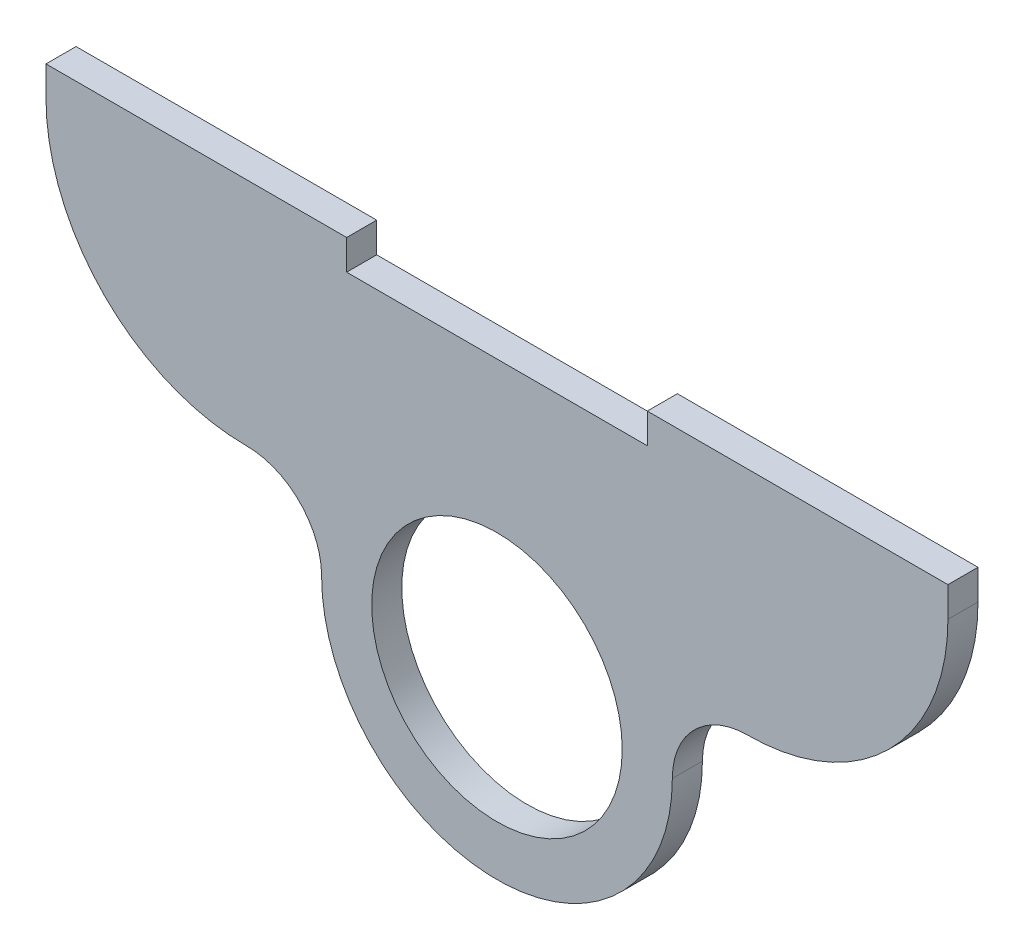
ISO-10303-21;
HEADER;
FILE_DESCRIPTION(('STEP AP214'),'2;1');
FILE_NAME('part.step','',(''),(''),'','','');
FILE_SCHEMA(('AUTOMOTIVE_DESIGN { 1 0 10303 214 1 1 1 1 }'));
ENDSEC;
DATA;
#1=APPLICATION_CONTEXT('core data for automotive mechanical design processes');
#2=APPLICATION_PROTOCOL_DEFINITION('international standard','automotive_design',2000,#1);
#3=PRODUCT_CONTEXT('',#1,'mechanical');
#4=PRODUCT('Part','Part','',(#3));
#5=PRODUCT_RELATED_PRODUCT_CATEGORY('part','',(#4));
#6=PRODUCT_DEFINITION_FORMATION('','',#4);
#7=PRODUCT_DEFINITION_CONTEXT('part definition',#1,'design');
#8=PRODUCT_DEFINITION('design','',#6,#7);
#9=PRODUCT_DEFINITION_SHAPE('','',#8);
#10=(LENGTH_UNIT() NAMED_UNIT(*) SI_UNIT(.MILLI.,.METRE.));
#11=(NAMED_UNIT(*) PLANE_ANGLE_UNIT() SI_UNIT($,.RADIAN.));
#12=(NAMED_UNIT(*) SI_UNIT($,.STERADIAN.) SOLID_ANGLE_UNIT());
#13=UNCERTAINTY_MEASURE_WITH_UNIT(LENGTH_MEASURE(1.E-05),#10,'distance_accuracy_value','');
#14=(GEOMETRIC_REPRESENTATION_CONTEXT(3) GLOBAL_UNCERTAINTY_ASSIGNED_CONTEXT((#13)) GLOBAL_UNIT_ASSIGNED_CONTEXT((#10,
#11,#12)) REPRESENTATION_CONTEXT('',''));
#15=CARTESIAN_POINT('',(0.,0.,0.));
#16=DIRECTION('',(0.,0.,1.));
#17=DIRECTION('',(1.,0.,0.));
#18=AXIS2_PLACEMENT_3D('',#15,#16,#17);
#19=CARTESIAN_POINT('',(-25.,27.5,3.));
#20=DIRECTION('',(0.,0.,1.));
#21=DIRECTION('',(1.,0.,0.));
#22=AXIS2_PLACEMENT_3D('',#19,#20,#21);
#23=PLANE('',#22);
#24=CARTESIAN_POINT('',(-25.,27.5,3.));
#25=DIRECTION('',(0.,0.,1.));
#26=DIRECTION('',(1.,0.,0.));
#27=AXIS2_PLACEMENT_3D('',#24,#25,#26);
#28=CIRCLE('',#27,20.);
#29=CARTESIAN_POINT('',(-45.,27.5,3.));
#30=VERTEX_POINT('',#29);
#31=CARTESIAN_POINT('',(-25.,7.5,3.));
#32=VERTEX_POINT('',#31);
#33=EDGE_CURVE('E187',#30,#32,#28,.T.);
#34=ORIENTED_EDGE('',*,*,#33,.T.);
#35=CARTESIAN_POINT('',(-25.,0.,3.));
#36=DIRECTION('',(0.,0.,-1.));
#37=DIRECTION('',(1.,0.,0.));
#38=AXIS2_PLACEMENT_3D('',#35,#36,#37);
#39=CIRCLE('',#38,7.5);
#40=CARTESIAN_POINT('',(-17.5,0.,3.));
#41=VERTEX_POINT('',#40);
#42=EDGE_CURVE('E115',#32,#41,#39,.T.);
#43=ORIENTED_EDGE('',*,*,#42,.T.);
#44=CARTESIAN_POINT('',(0.,0.,3.));
#45=DIRECTION('',(0.,0.,1.));
#46=DIRECTION('',(1.,0.,0.));
#47=AXIS2_PLACEMENT_3D('',#44,#45,#46);
#48=CIRCLE('',#47,17.5);
#49=CARTESIAN_POINT('',(17.5,0.,3.));
#50=VERTEX_POINT('',#49);
#51=EDGE_CURVE('E214',#41,#50,#48,.T.);
#52=ORIENTED_EDGE('',*,*,#51,.T.);
#53=CARTESIAN_POINT('',(25.,0.,3.));
#54=DIRECTION('',(0.,0.,-1.));
#55=DIRECTION('',(-1.,0.,0.));
#56=AXIS2_PLACEMENT_3D('',#53,#54,#55);
#57=CIRCLE('',#56,7.5);
#58=CARTESIAN_POINT('',(25.,7.5,3.));
#59=VERTEX_POINT('',#58);
#60=EDGE_CURVE('E233',#50,#59,#57,.T.);
#61=ORIENTED_EDGE('',*,*,#60,.T.);
#62=CARTESIAN_POINT('',(25.,27.5,3.));
#63=DIRECTION('',(0.,0.,1.));
#64=DIRECTION('',(1.,0.,0.));
#65=AXIS2_PLACEMENT_3D('',#62,#63,#64);
#66=CIRCLE('',#65,20.);
#67=CARTESIAN_POINT('',(45.,27.5,3.));
#68=VERTEX_POINT('',#67);
#69=EDGE_CURVE('E230',#59,#68,#66,.T.);
#70=ORIENTED_EDGE('',*,*,#69,.T.);
#71=DIRECTION('',(0.,1.,0.));
#72=VECTOR('',#71,1.);
#73=CARTESIAN_POINT('',(45.,27.5,3.));
#74=LINE('',#73,#72);
#75=CARTESIAN_POINT('',(45.,30.5,3.));
#76=VERTEX_POINT('',#75);
#77=EDGE_CURVE('E232',#68,#76,#74,.T.);
#78=ORIENTED_EDGE('',*,*,#77,.T.);
#79=DIRECTION('',(-1.,0.,0.));
#80=VECTOR('',#79,1.);
#81=CARTESIAN_POINT('',(45.,30.5,3.));
#82=LINE('',#81,#80);
#83=CARTESIAN_POINT('',(15.,30.5,3.));
#84=VERTEX_POINT('',#83);
#85=EDGE_CURVE('E235',#76,#84,#82,.T.);
#86=ORIENTED_EDGE('',*,*,#85,.T.);
#87=DIRECTION('',(0.,-1.,0.));
#88=VECTOR('',#87,1.);
#89=CARTESIAN_POINT('',(15.,27.5,3.));
#90=LINE('',#89,#88);
#91=CARTESIAN_POINT('',(15.,27.5,3.));
#92=VERTEX_POINT('',#91);
#93=EDGE_CURVE('E241',#84,#92,#90,.T.);
#94=ORIENTED_EDGE('',*,*,#93,.T.);
#95=DIRECTION('',(-1.,0.,0.));
#96=VECTOR('',#95,1.);
#97=CARTESIAN_POINT('',(-15.,27.5,3.));
#98=LINE('',#97,#96);
#99=CARTESIAN_POINT('',(-15.,27.5,3.));
#100=VERTEX_POINT('',#99);
#101=EDGE_CURVE('E146',#92,#100,#98,.T.);
#102=ORIENTED_EDGE('',*,*,#101,.T.);
#103=DIRECTION('',(0.,1.,0.));
#104=VECTOR('',#103,1.);
#105=CARTESIAN_POINT('',(-15.,27.5,3.));
#106=LINE('',#105,#104);
#107=CARTESIAN_POINT('',(-15.,30.5,3.));
#108=VERTEX_POINT('',#107);
#109=EDGE_CURVE('E140',#100,#108,#106,.T.);
#110=ORIENTED_EDGE('',*,*,#109,.T.);
#111=DIRECTION('',(-1.,0.,0.));
#112=VECTOR('',#111,1.);
#113=CARTESIAN_POINT('',(-45.,30.5,3.));
#114=LINE('',#113,#112);
#115=CARTESIAN_POINT('',(-45.,30.5,3.));
#116=VERTEX_POINT('',#115);
#117=EDGE_CURVE('E144',#108,#116,#114,.T.);
#118=ORIENTED_EDGE('',*,*,#117,.T.);
#119=DIRECTION('',(0.,-1.,0.));
#120=VECTOR('',#119,1.);
#121=CARTESIAN_POINT('',(-45.,27.5,3.));
#122=LINE('',#121,#120);
#123=EDGE_CURVE('E60',#116,#30,#122,.T.);
#124=ORIENTED_EDGE('',*,*,#123,.T.);
#125=EDGE_LOOP('',(#34,#43,#52,#61,#70,#78,#86,#94,#102,#110,#118,#124));
#126=FACE_BOUND('',#125,.T.);
#127=CARTESIAN_POINT('',(0.,0.,3.));
#128=DIRECTION('',(0.,0.,1.));
#129=DIRECTION('',(1.,0.,0.));
#130=AXIS2_PLACEMENT_3D('',#127,#128,#129);
#131=CIRCLE('',#130,12.5);
#132=CARTESIAN_POINT('',(12.5,0.,3.));
#133=VERTEX_POINT('',#132);
#134=EDGE_CURVE('E168',#133,#133,#131,.T.);
#135=ORIENTED_EDGE('',*,*,#134,.F.);
#136=EDGE_LOOP('',(#135));
#137=FACE_BOUND('',#136,.T.);
#138=ADVANCED_FACE('F43',(#126,#137),#23,.T.);
#139=CARTESIAN_POINT('',(-25.,27.5,0.));
#140=DIRECTION('',(0.,0.,1.));
#141=DIRECTION('',(1.,0.,0.));
#142=AXIS2_PLACEMENT_3D('',#139,#140,#141);
#143=PLANE('',#142);
#144=CARTESIAN_POINT('',(-25.,27.5,0.));
#145=DIRECTION('',(0.,0.,1.));
#146=DIRECTION('',(1.,0.,0.));
#147=AXIS2_PLACEMENT_3D('',#144,#145,#146);
#148=CIRCLE('',#147,20.);
#149=CARTESIAN_POINT('',(-45.,27.5,0.));
#150=VERTEX_POINT('',#149);
#151=CARTESIAN_POINT('',(-25.,7.5,0.));
#152=VERTEX_POINT('',#151);
#153=EDGE_CURVE('E164',#150,#152,#148,.T.);
#154=ORIENTED_EDGE('',*,*,#153,.F.);
#155=DIRECTION('',(0.,-1.,0.));
#156=VECTOR('',#155,1.);
#157=CARTESIAN_POINT('',(-45.,27.5,0.));
#158=LINE('',#157,#156);
#159=CARTESIAN_POINT('',(-45.,30.5,0.));
#160=VERTEX_POINT('',#159);
#161=EDGE_CURVE('E107',#160,#150,#158,.T.);
#162=ORIENTED_EDGE('',*,*,#161,.F.);
#163=DIRECTION('',(-1.,0.,0.));
#164=VECTOR('',#163,1.);
#165=CARTESIAN_POINT('',(-45.,30.5,0.));
#166=LINE('',#165,#164);
#167=CARTESIAN_POINT('',(-15.,30.5,0.));
#168=VERTEX_POINT('',#167);
#169=EDGE_CURVE('E101',#168,#160,#166,.T.);
#170=ORIENTED_EDGE('',*,*,#169,.F.);
#171=DIRECTION('',(0.,1.,0.));
#172=VECTOR('',#171,1.);
#173=CARTESIAN_POINT('',(-15.,27.5,0.));
#174=LINE('',#173,#172);
#175=CARTESIAN_POINT('',(-15.,27.5,0.));
#176=VERTEX_POINT('',#175);
#177=EDGE_CURVE('E154',#176,#168,#174,.T.);
#178=ORIENTED_EDGE('',*,*,#177,.F.);
#179=DIRECTION('',(-1.,0.,0.));
#180=VECTOR('',#179,1.);
#181=CARTESIAN_POINT('',(-15.,27.5,0.));
#182=LINE('',#181,#180);
#183=CARTESIAN_POINT('',(15.,27.5,0.));
#184=VERTEX_POINT('',#183);
#185=EDGE_CURVE('E182',#184,#176,#182,.T.);
#186=ORIENTED_EDGE('',*,*,#185,.F.);
#187=DIRECTION('',(0.,-1.,0.));
#188=VECTOR('',#187,1.);
#189=CARTESIAN_POINT('',(15.,27.5,0.));
#190=LINE('',#189,#188);
#191=CARTESIAN_POINT('',(15.,30.5,0.));
#192=VERTEX_POINT('',#191);
#193=EDGE_CURVE('E180',#192,#184,#190,.T.);
#194=ORIENTED_EDGE('',*,*,#193,.F.);
#195=DIRECTION('',(-1.,0.,0.));
#196=VECTOR('',#195,1.);
#197=CARTESIAN_POINT('',(45.,30.5,0.));
#198=LINE('',#197,#196);
#199=CARTESIAN_POINT('',(45.,30.5,0.));
#200=VERTEX_POINT('',#199);
#201=EDGE_CURVE('E178',#200,#192,#198,.T.);
#202=ORIENTED_EDGE('',*,*,#201,.F.);
#203=DIRECTION('',(0.,1.,0.));
#204=VECTOR('',#203,1.);
#205=CARTESIAN_POINT('',(45.,27.5,0.));
#206=LINE('',#205,#204);
#207=CARTESIAN_POINT('',(45.,27.5,0.));
#208=VERTEX_POINT('',#207);
#209=EDGE_CURVE('E176',#208,#200,#206,.T.);
#210=ORIENTED_EDGE('',*,*,#209,.F.);
#211=CARTESIAN_POINT('',(25.,27.5,0.));
#212=DIRECTION('',(0.,0.,1.));
#213=DIRECTION('',(1.,0.,0.));
#214=AXIS2_PLACEMENT_3D('',#211,#212,#213);
#215=CIRCLE('',#214,20.);
#216=CARTESIAN_POINT('',(25.,7.5,0.));
#217=VERTEX_POINT('',#216);
#218=EDGE_CURVE('E174',#217,#208,#215,.T.);
#219=ORIENTED_EDGE('',*,*,#218,.F.);
#220=CARTESIAN_POINT('',(25.,0.,0.));
#221=DIRECTION('',(0.,0.,-1.));
#222=DIRECTION('',(-1.,0.,0.));
#223=AXIS2_PLACEMENT_3D('',#220,#221,#222);
#224=CIRCLE('',#223,7.5);
#225=CARTESIAN_POINT('',(17.5,0.,0.));
#226=VERTEX_POINT('',#225);
#227=EDGE_CURVE('E172',#226,#217,#224,.T.);
#228=ORIENTED_EDGE('',*,*,#227,.F.);
#229=CARTESIAN_POINT('',(0.,0.,0.));
#230=DIRECTION('',(0.,0.,1.));
#231=DIRECTION('',(1.,0.,0.));
#232=AXIS2_PLACEMENT_3D('',#229,#230,#231);
#233=CIRCLE('',#232,17.5);
#234=CARTESIAN_POINT('',(-17.5,0.,0.));
#235=VERTEX_POINT('',#234);
#236=EDGE_CURVE('E170',#235,#226,#233,.T.);
#237=ORIENTED_EDGE('',*,*,#236,.F.);
#238=CARTESIAN_POINT('',(-25.,0.,0.));
#239=DIRECTION('',(0.,0.,-1.));
#240=DIRECTION('',(1.,0.,0.));
#241=AXIS2_PLACEMENT_3D('',#238,#239,#240);
#242=CIRCLE('',#241,7.5);
#243=EDGE_CURVE('E167',#152,#235,#242,.T.);
#244=ORIENTED_EDGE('',*,*,#243,.F.);
#245=EDGE_LOOP('',(#154,#162,#170,#178,#186,#194,#202,#210,#219,#228,#237,#244));
#246=FACE_BOUND('',#245,.T.);
#247=CARTESIAN_POINT('',(0.,0.,0.));
#248=DIRECTION('',(0.,0.,1.));
#249=DIRECTION('',(1.,0.,0.));
#250=AXIS2_PLACEMENT_3D('',#247,#248,#249);
#251=CIRCLE('',#250,12.5);
#252=CARTESIAN_POINT('',(12.5,0.,0.));
#253=VERTEX_POINT('',#252);
#254=EDGE_CURVE('E388',#253,#253,#251,.T.);
#255=ORIENTED_EDGE('',*,*,#254,.T.);
#256=EDGE_LOOP('',(#255));
#257=FACE_BOUND('',#256,.T.);
#258=ADVANCED_FACE('F218',(#246,#257),#143,.F.);
#259=CARTESIAN_POINT('',(-25.,27.5,3.));
#260=DIRECTION('',(0.,0.,-1.));
#261=DIRECTION('',(-1.,0.,0.));
#262=AXIS2_PLACEMENT_3D('',#259,#260,#261);
#263=CYLINDRICAL_SURFACE('',#262,20.);
#264=ORIENTED_EDGE('',*,*,#153,.T.);
#265=DIRECTION('',(0.,0.,-1.));
#266=VECTOR('',#265,1.);
#267=CARTESIAN_POINT('',(-25.,7.5,3.));
#268=LINE('',#267,#266);
#269=EDGE_CURVE('E13',#32,#152,#268,.T.);
#270=ORIENTED_EDGE('',*,*,#269,.F.);
#271=ORIENTED_EDGE('',*,*,#33,.F.);
#272=DIRECTION('',(0.,0.,-1.));
#273=VECTOR('',#272,1.);
#274=CARTESIAN_POINT('',(-45.,27.5,3.));
#275=LINE('',#274,#273);
#276=EDGE_CURVE('E160',#30,#150,#275,.T.);
#277=ORIENTED_EDGE('',*,*,#276,.T.);
#278=EDGE_LOOP('',(#264,#270,#271,#277));
#279=FACE_BOUND('',#278,.T.);
#280=ADVANCED_FACE('F45',(#279),#263,.T.);
#281=CARTESIAN_POINT('',(-25.,0.,3.));
#282=DIRECTION('',(0.,0.,-1.));
#283=DIRECTION('',(-1.,0.,0.));
#284=AXIS2_PLACEMENT_3D('',#281,#282,#283);
#285=CYLINDRICAL_SURFACE('',#284,7.5);
#286=ORIENTED_EDGE('',*,*,#243,.T.);
#287=DIRECTION('',(0.,0.,-1.));
#288=VECTOR('',#287,1.);
#289=CARTESIAN_POINT('',(-17.5,0.,3.));
#290=LINE('',#289,#288);
#291=EDGE_CURVE('E52',#41,#235,#290,.T.);
#292=ORIENTED_EDGE('',*,*,#291,.F.);
#293=ORIENTED_EDGE('',*,*,#42,.F.);
#294=ORIENTED_EDGE('',*,*,#269,.T.);
#295=EDGE_LOOP('',(#286,#292,#293,#294));
#296=FACE_BOUND('',#295,.T.);
#297=ADVANCED_FACE('F275',(#296),#285,.F.);
#298=CARTESIAN_POINT('',(0.,0.,3.));
#299=DIRECTION('',(0.,0.,-1.));
#300=DIRECTION('',(-1.,0.,0.));
#301=AXIS2_PLACEMENT_3D('',#298,#299,#300);
#302=CYLINDRICAL_SURFACE('',#301,17.5);
#303=ORIENTED_EDGE('',*,*,#236,.T.);
#304=DIRECTION('',(0.,0.,-1.));
#305=VECTOR('',#304,1.);
#306=CARTESIAN_POINT('',(17.5,0.,3.));
#307=LINE('',#306,#305);
#308=EDGE_CURVE('E206',#50,#226,#307,.T.);
#309=ORIENTED_EDGE('',*,*,#308,.F.);
#310=ORIENTED_EDGE('',*,*,#51,.F.);
#311=ORIENTED_EDGE('',*,*,#291,.T.);
#312=EDGE_LOOP('',(#303,#309,#310,#311));
#313=FACE_BOUND('',#312,.T.);
#314=ADVANCED_FACE('F212',(#313),#302,.T.);
#315=CARTESIAN_POINT('',(25.,0.,3.));
#316=DIRECTION('',(0.,0.,-1.));
#317=DIRECTION('',(-1.,0.,0.));
#318=AXIS2_PLACEMENT_3D('',#315,#316,#317);
#319=CYLINDRICAL_SURFACE('',#318,7.5);
#320=ORIENTED_EDGE('',*,*,#227,.T.);
#321=DIRECTION('',(0.,0.,-1.));
#322=VECTOR('',#321,1.);
#323=CARTESIAN_POINT('',(25.,7.5,3.));
#324=LINE('',#323,#322);
#325=EDGE_CURVE('E203',#59,#217,#324,.T.);
#326=ORIENTED_EDGE('',*,*,#325,.F.);
#327=ORIENTED_EDGE('',*,*,#60,.F.);
#328=ORIENTED_EDGE('',*,*,#308,.T.);
#329=EDGE_LOOP('',(#320,#326,#327,#328));
#330=FACE_BOUND('',#329,.T.);
#331=ADVANCED_FACE('F224',(#330),#319,.F.);
#332=CARTESIAN_POINT('',(25.,27.5,3.));
#333=DIRECTION('',(0.,0.,-1.));
#334=DIRECTION('',(-1.,0.,0.));
#335=AXIS2_PLACEMENT_3D('',#332,#333,#334);
#336=CYLINDRICAL_SURFACE('',#335,20.);
#337=ORIENTED_EDGE('',*,*,#218,.T.);
#338=DIRECTION('',(0.,0.,-1.));
#339=VECTOR('',#338,1.);
#340=CARTESIAN_POINT('',(45.,27.5,3.));
#341=LINE('',#340,#339);
#342=EDGE_CURVE('E200',#68,#208,#341,.T.);
#343=ORIENTED_EDGE('',*,*,#342,.F.);
#344=ORIENTED_EDGE('',*,*,#69,.F.);
#345=ORIENTED_EDGE('',*,*,#325,.T.);
#346=EDGE_LOOP('',(#337,#343,#344,#345));
#347=FACE_BOUND('',#346,.T.);
#348=ADVANCED_FACE('F228',(#347),#336,.T.);
#349=CARTESIAN_POINT('',(45.,27.5,3.));
#350=DIRECTION('',(-1.,0.,0.));
#351=DIRECTION('',(0.,0.,1.));
#352=AXIS2_PLACEMENT_3D('',#349,#350,#351);
#353=PLANE('',#352);
#354=ORIENTED_EDGE('',*,*,#209,.T.);
#355=DIRECTION('',(0.,0.,-1.));
#356=VECTOR('',#355,1.);
#357=CARTESIAN_POINT('',(45.,30.5,3.));
#358=LINE('',#357,#356);
#359=EDGE_CURVE('E197',#76,#200,#358,.T.);
#360=ORIENTED_EDGE('',*,*,#359,.F.);
#361=ORIENTED_EDGE('',*,*,#77,.F.);
#362=ORIENTED_EDGE('',*,*,#342,.T.);
#363=EDGE_LOOP('',(#354,#360,#361,#362));
#364=FACE_BOUND('',#363,.T.);
#365=ADVANCED_FACE('F288',(#364),#353,.F.);
#366=CARTESIAN_POINT('',(45.,30.5,3.));
#367=DIRECTION('',(0.,-1.,0.));
#368=DIRECTION('',(0.,0.,-1.));
#369=AXIS2_PLACEMENT_3D('',#366,#367,#368);
#370=PLANE('',#369);
#371=ORIENTED_EDGE('',*,*,#201,.T.);
#372=DIRECTION('',(0.,0.,-1.));
#373=VECTOR('',#372,1.);
#374=CARTESIAN_POINT('',(15.,30.5,3.));
#375=LINE('',#374,#373);
#376=EDGE_CURVE('E194',#84,#192,#375,.T.);
#377=ORIENTED_EDGE('',*,*,#376,.F.);
#378=ORIENTED_EDGE('',*,*,#85,.F.);
#379=ORIENTED_EDGE('',*,*,#359,.T.);
#380=EDGE_LOOP('',(#371,#377,#378,#379));
#381=FACE_BOUND('',#380,.T.);
#382=ADVANCED_FACE('F291',(#381),#370,.F.);
#383=CARTESIAN_POINT('',(15.,27.5,3.));
#384=DIRECTION('',(1.,0.,0.));
#385=DIRECTION('',(0.,0.,-1.));
#386=AXIS2_PLACEMENT_3D('',#383,#384,#385);
#387=PLANE('',#386);
#388=ORIENTED_EDGE('',*,*,#193,.T.);
#389=DIRECTION('',(0.,0.,-1.));
#390=VECTOR('',#389,1.);
#391=CARTESIAN_POINT('',(15.,27.5,3.));
#392=LINE('',#391,#390);
#393=EDGE_CURVE('E191',#92,#184,#392,.T.);
#394=ORIENTED_EDGE('',*,*,#393,.F.);
#395=ORIENTED_EDGE('',*,*,#93,.F.);
#396=ORIENTED_EDGE('',*,*,#376,.T.);
#397=EDGE_LOOP('',(#388,#394,#395,#396));
#398=FACE_BOUND('',#397,.T.);
#399=ADVANCED_FACE('F247',(#398),#387,.F.);
#400=CARTESIAN_POINT('',(-15.,27.5,3.));
#401=DIRECTION('',(0.,-1.,0.));
#402=DIRECTION('',(0.,0.,-1.));
#403=AXIS2_PLACEMENT_3D('',#400,#401,#402);
#404=PLANE('',#403);
#405=ORIENTED_EDGE('',*,*,#185,.T.);
#406=DIRECTION('',(0.,0.,-1.));
#407=VECTOR('',#406,1.);
#408=CARTESIAN_POINT('',(-15.,27.5,3.));
#409=LINE('',#408,#407);
#410=EDGE_CURVE('E155',#100,#176,#409,.T.);
#411=ORIENTED_EDGE('',*,*,#410,.F.);
#412=ORIENTED_EDGE('',*,*,#101,.F.);
#413=ORIENTED_EDGE('',*,*,#393,.T.);
#414=EDGE_LOOP('',(#405,#411,#412,#413));
#415=FACE_BOUND('',#414,.T.);
#416=ADVANCED_FACE('F251',(#415),#404,.F.);
#417=CARTESIAN_POINT('',(-15.,27.5,3.));
#418=DIRECTION('',(-1.,0.,0.));
#419=DIRECTION('',(0.,0.,1.));
#420=AXIS2_PLACEMENT_3D('',#417,#418,#419);
#421=PLANE('',#420);
#422=ORIENTED_EDGE('',*,*,#177,.T.);
#423=DIRECTION('',(0.,0.,-1.));
#424=VECTOR('',#423,1.);
#425=CARTESIAN_POINT('',(-15.,30.5,3.));
#426=LINE('',#425,#424);
#427=EDGE_CURVE('E151',#108,#168,#426,.T.);
#428=ORIENTED_EDGE('',*,*,#427,.F.);
#429=ORIENTED_EDGE('',*,*,#109,.F.);
#430=ORIENTED_EDGE('',*,*,#410,.T.);
#431=EDGE_LOOP('',(#422,#428,#429,#430));
#432=FACE_BOUND('',#431,.T.);
#433=ADVANCED_FACE('F152',(#432),#421,.F.);
#434=CARTESIAN_POINT('',(-45.,30.5,3.));
#435=DIRECTION('',(0.,-1.,0.));
#436=DIRECTION('',(0.,0.,-1.));
#437=AXIS2_PLACEMENT_3D('',#434,#435,#436);
#438=PLANE('',#437);
#439=ORIENTED_EDGE('',*,*,#169,.T.);
#440=DIRECTION('',(0.,0.,-1.));
#441=VECTOR('',#440,1.);
#442=CARTESIAN_POINT('',(-45.,30.5,3.));
#443=LINE('',#442,#441);
#444=EDGE_CURVE('E156',#116,#160,#443,.T.);
#445=ORIENTED_EDGE('',*,*,#444,.F.);
#446=ORIENTED_EDGE('',*,*,#117,.F.);
#447=ORIENTED_EDGE('',*,*,#427,.T.);
#448=EDGE_LOOP('',(#439,#445,#446,#447));
#449=FACE_BOUND('',#448,.T.);
#450=ADVANCED_FACE('F158',(#449),#438,.F.);
#451=CARTESIAN_POINT('',(-45.,27.5,3.));
#452=DIRECTION('',(1.,0.,0.));
#453=DIRECTION('',(0.,0.,-1.));
#454=AXIS2_PLACEMENT_3D('',#451,#452,#453);
#455=PLANE('',#454);
#456=ORIENTED_EDGE('',*,*,#161,.T.);
#457=ORIENTED_EDGE('',*,*,#276,.F.);
#458=ORIENTED_EDGE('',*,*,#123,.F.);
#459=ORIENTED_EDGE('',*,*,#444,.T.);
#460=EDGE_LOOP('',(#456,#457,#458,#459));
#461=FACE_BOUND('',#460,.T.);
#462=ADVANCED_FACE('F255',(#461),#455,.F.);
#463=CARTESIAN_POINT('',(0.,0.,3.));
#464=DIRECTION('',(0.,0.,-1.));
#465=DIRECTION('',(-1.,0.,0.));
#466=AXIS2_PLACEMENT_3D('',#463,#464,#465);
#467=CYLINDRICAL_SURFACE('',#466,12.5);
#468=ORIENTED_EDGE('',*,*,#134,.T.);
#469=EDGE_LOOP('',(#468));
#470=FACE_BOUND('',#469,.T.);
#471=ORIENTED_EDGE('',*,*,#254,.F.);
#472=EDGE_LOOP('',(#471));
#473=FACE_BOUND('',#472,.T.);
#474=ADVANCED_FACE('F257',(#470,#473),#467,.F.);
#475=CLOSED_SHELL('',(#138,#258,#280,#297,#314,#331,#348,#365,#382,#399,#416,#433,#450,#462,#474));
#476=MANIFOLD_SOLID_BREP('B2',#475);
#477=ADVANCED_BREP_SHAPE_REPRESENTATION('',(#18,#476),#14);
#478=SHAPE_DEFINITION_REPRESENTATION(#9,#477);
ENDSEC;
END-ISO-10303-21;
